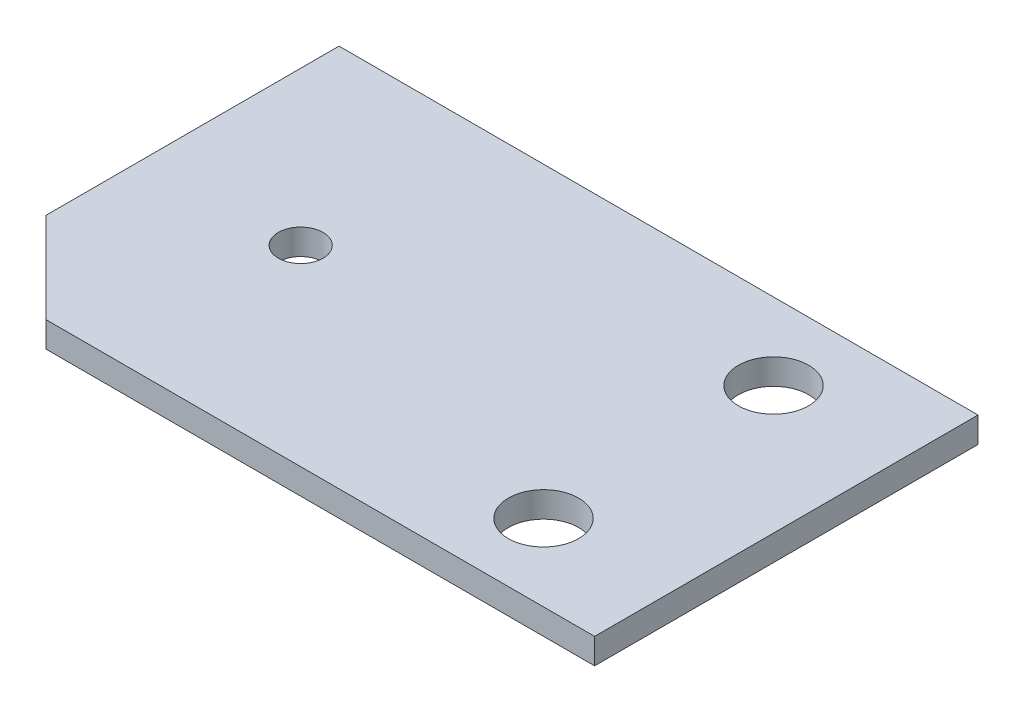
ISO-10303-21;
HEADER;
FILE_DESCRIPTION(('STEP AP214'),'2;1');
FILE_NAME('part.step','',(''),(''),'','','');
FILE_SCHEMA(('AUTOMOTIVE_DESIGN { 1 0 10303 214 1 1 1 1 }'));
ENDSEC;
DATA;
#1=APPLICATION_CONTEXT('core data for automotive mechanical design processes');
#2=APPLICATION_PROTOCOL_DEFINITION('international standard','automotive_design',2000,#1);
#3=PRODUCT_CONTEXT('',#1,'mechanical');
#4=PRODUCT('Part','Part','',(#3));
#5=PRODUCT_RELATED_PRODUCT_CATEGORY('part','',(#4));
#6=PRODUCT_DEFINITION_FORMATION('','',#4);
#7=PRODUCT_DEFINITION_CONTEXT('part definition',#1,'design');
#8=PRODUCT_DEFINITION('design','',#6,#7);
#9=PRODUCT_DEFINITION_SHAPE('','',#8);
#10=(LENGTH_UNIT() NAMED_UNIT(*) SI_UNIT(.MILLI.,.METRE.));
#11=(NAMED_UNIT(*) PLANE_ANGLE_UNIT() SI_UNIT($,.RADIAN.));
#12=(NAMED_UNIT(*) SI_UNIT($,.STERADIAN.) SOLID_ANGLE_UNIT());
#13=UNCERTAINTY_MEASURE_WITH_UNIT(LENGTH_MEASURE(1.E-05),#10,'distance_accuracy_value','');
#14=(GEOMETRIC_REPRESENTATION_CONTEXT(3) GLOBAL_UNCERTAINTY_ASSIGNED_CONTEXT((#13)) GLOBAL_UNIT_ASSIGNED_CONTEXT((#10,
#11,#12)) REPRESENTATION_CONTEXT('',''));
#15=CARTESIAN_POINT('',(0.,0.,0.));
#16=DIRECTION('',(0.,0.,1.));
#17=DIRECTION('',(1.,0.,0.));
#18=AXIS2_PLACEMENT_3D('',#15,#16,#17);
#19=CARTESIAN_POINT('',(0.,2.,-30.));
#20=DIRECTION('',(1.,0.,0.));
#21=DIRECTION('',(0.,0.,-1.));
#22=AXIS2_PLACEMENT_3D('',#19,#20,#21);
#23=PLANE('',#22);
#24=DIRECTION('',(0.,0.,1.));
#25=VECTOR('',#24,1.);
#26=CARTESIAN_POINT('',(0.,0.,-30.));
#27=LINE('',#26,#25);
#28=CARTESIAN_POINT('',(0.,0.,-30.));
#29=VERTEX_POINT('',#28);
#30=CARTESIAN_POINT('',(0.,0.,-7.07106781186549));
#31=VERTEX_POINT('',#30);
#32=EDGE_CURVE('E107',#29,#31,#27,.T.);
#33=ORIENTED_EDGE('',*,*,#32,.T.);
#34=DIRECTION('',(0.,1.,0.));
#35=VECTOR('',#34,1.);
#36=CARTESIAN_POINT('',(0.,0.,-7.07106781186549));
#37=LINE('',#36,#35);
#38=CARTESIAN_POINT('',(0.,2.,-7.07106781186549));
#39=VERTEX_POINT('',#38);
#40=EDGE_CURVE('E51',#31,#39,#37,.T.);
#41=ORIENTED_EDGE('',*,*,#40,.T.);
#42=DIRECTION('',(0.,0.,1.));
#43=VECTOR('',#42,1.);
#44=CARTESIAN_POINT('',(0.,2.,-30.));
#45=LINE('',#44,#43);
#46=CARTESIAN_POINT('',(0.,2.,-30.));
#47=VERTEX_POINT('',#46);
#48=EDGE_CURVE('E115',#47,#39,#45,.T.);
#49=ORIENTED_EDGE('',*,*,#48,.F.);
#50=DIRECTION('',(0.,-1.,0.));
#51=VECTOR('',#50,1.);
#52=CARTESIAN_POINT('',(0.,2.,-30.));
#53=LINE('',#52,#51);
#54=EDGE_CURVE('E116',#47,#29,#53,.T.);
#55=ORIENTED_EDGE('',*,*,#54,.T.);
#56=EDGE_LOOP('',(#33,#41,#49,#55));
#57=FACE_BOUND('',#56,.T.);
#58=ADVANCED_FACE('F37',(#57),#23,.F.);
#59=CARTESIAN_POINT('',(0.,2.,0.));
#60=DIRECTION('',(0.,0.,-1.));
#61=DIRECTION('',(-1.,0.,0.));
#62=AXIS2_PLACEMENT_3D('',#59,#60,#61);
#63=PLANE('',#62);
#64=DIRECTION('',(1.,0.,0.));
#65=VECTOR('',#64,1.);
#66=CARTESIAN_POINT('',(0.,2.,0.));
#67=LINE('',#66,#65);
#68=CARTESIAN_POINT('',(7.07106781186546,2.,0.));
#69=VERTEX_POINT('',#68);
#70=CARTESIAN_POINT('',(50.,2.,0.));
#71=VERTEX_POINT('',#70);
#72=EDGE_CURVE('E82',#69,#71,#67,.T.);
#73=ORIENTED_EDGE('',*,*,#72,.F.);
#74=DIRECTION('',(0.,1.,0.));
#75=VECTOR('',#74,1.);
#76=CARTESIAN_POINT('',(7.07106781186546,0.,0.));
#77=LINE('',#76,#75);
#78=CARTESIAN_POINT('',(7.07106781186546,0.,0.));
#79=VERTEX_POINT('',#78);
#80=EDGE_CURVE('E93',#79,#69,#77,.T.);
#81=ORIENTED_EDGE('',*,*,#80,.F.);
#82=DIRECTION('',(1.,0.,0.));
#83=VECTOR('',#82,1.);
#84=CARTESIAN_POINT('',(0.,0.,0.));
#85=LINE('',#84,#83);
#86=CARTESIAN_POINT('',(50.,0.,0.));
#87=VERTEX_POINT('',#86);
#88=EDGE_CURVE('E102',#79,#87,#85,.T.);
#89=ORIENTED_EDGE('',*,*,#88,.T.);
#90=DIRECTION('',(0.,-1.,0.));
#91=VECTOR('',#90,1.);
#92=CARTESIAN_POINT('',(50.,2.,0.));
#93=LINE('',#92,#91);
#94=EDGE_CURVE('E11',#71,#87,#93,.T.);
#95=ORIENTED_EDGE('',*,*,#94,.F.);
#96=EDGE_LOOP('',(#73,#81,#89,#95));
#97=FACE_BOUND('',#96,.T.);
#98=ADVANCED_FACE('F101',(#97),#63,.F.);
#99=CARTESIAN_POINT('',(50.,2.,0.));
#100=DIRECTION('',(-1.,0.,0.));
#101=DIRECTION('',(0.,0.,1.));
#102=AXIS2_PLACEMENT_3D('',#99,#100,#101);
#103=PLANE('',#102);
#104=DIRECTION('',(0.,0.,-1.));
#105=VECTOR('',#104,1.);
#106=CARTESIAN_POINT('',(50.,0.,0.));
#107=LINE('',#106,#105);
#108=CARTESIAN_POINT('',(50.,0.,-30.));
#109=VERTEX_POINT('',#108);
#110=EDGE_CURVE('E106',#87,#109,#107,.T.);
#111=ORIENTED_EDGE('',*,*,#110,.T.);
#112=DIRECTION('',(0.,-1.,0.));
#113=VECTOR('',#112,1.);
#114=CARTESIAN_POINT('',(50.,2.,-30.));
#115=LINE('',#114,#113);
#116=CARTESIAN_POINT('',(50.,2.,-30.));
#117=VERTEX_POINT('',#116);
#118=EDGE_CURVE('E44',#117,#109,#115,.T.);
#119=ORIENTED_EDGE('',*,*,#118,.F.);
#120=DIRECTION('',(0.,0.,-1.));
#121=VECTOR('',#120,1.);
#122=CARTESIAN_POINT('',(50.,2.,0.));
#123=LINE('',#122,#121);
#124=EDGE_CURVE('E124',#71,#117,#123,.T.);
#125=ORIENTED_EDGE('',*,*,#124,.F.);
#126=ORIENTED_EDGE('',*,*,#94,.T.);
#127=EDGE_LOOP('',(#111,#119,#125,#126));
#128=FACE_BOUND('',#127,.T.);
#129=ADVANCED_FACE('F132',(#128),#103,.F.);
#130=CARTESIAN_POINT('',(50.,2.,-30.));
#131=DIRECTION('',(0.,0.,1.));
#132=DIRECTION('',(1.,0.,0.));
#133=AXIS2_PLACEMENT_3D('',#130,#131,#132);
#134=PLANE('',#133);
#135=DIRECTION('',(-1.,0.,0.));
#136=VECTOR('',#135,1.);
#137=CARTESIAN_POINT('',(50.,0.,-30.));
#138=LINE('',#137,#136);
#139=EDGE_CURVE('E77',#109,#29,#138,.T.);
#140=ORIENTED_EDGE('',*,*,#139,.T.);
#141=ORIENTED_EDGE('',*,*,#54,.F.);
#142=DIRECTION('',(-1.,0.,0.));
#143=VECTOR('',#142,1.);
#144=CARTESIAN_POINT('',(50.,2.,-30.));
#145=LINE('',#144,#143);
#146=EDGE_CURVE('E60',#117,#47,#145,.T.);
#147=ORIENTED_EDGE('',*,*,#146,.F.);
#148=ORIENTED_EDGE('',*,*,#118,.T.);
#149=EDGE_LOOP('',(#140,#141,#147,#148));
#150=FACE_BOUND('',#149,.T.);
#151=ADVANCED_FACE('F118',(#150),#134,.F.);
#152=CARTESIAN_POINT('',(0.,2.,0.));
#153=DIRECTION('',(0.,1.,0.));
#154=DIRECTION('',(0.,0.,1.));
#155=AXIS2_PLACEMENT_3D('',#152,#153,#154);
#156=PLANE('',#155);
#157=CARTESIAN_POINT('',(39.9999999999999,2.,-24.));
#158=DIRECTION('',(0.,1.,0.));
#159=DIRECTION('',(0.,0.,1.));
#160=AXIS2_PLACEMENT_3D('',#157,#158,#159);
#161=CIRCLE('',#160,2.75000000000001);
#162=CARTESIAN_POINT('',(39.9999999999999,2.,-21.25));
#163=VERTEX_POINT('',#162);
#164=EDGE_CURVE('E216',#163,#163,#161,.T.);
#165=ORIENTED_EDGE('',*,*,#164,.F.);
#166=EDGE_LOOP('',(#165));
#167=FACE_BOUND('',#166,.T.);
#168=DIRECTION('',(-0.707106781186546,0.,-0.707106781186549));
#169=VECTOR('',#168,1.);
#170=CARTESIAN_POINT('',(0.,2.,-7.07106781186549));
#171=LINE('',#170,#169);
#172=EDGE_CURVE('E98',#69,#39,#171,.T.);
#173=ORIENTED_EDGE('',*,*,#172,.F.);
#174=ORIENTED_EDGE('',*,*,#72,.T.);
#175=ORIENTED_EDGE('',*,*,#124,.T.);
#176=ORIENTED_EDGE('',*,*,#146,.T.);
#177=ORIENTED_EDGE('',*,*,#48,.T.);
#178=EDGE_LOOP('',(#173,#174,#175,#176,#177));
#179=FACE_BOUND('',#178,.T.);
#180=CARTESIAN_POINT('',(12.,2.,-15.));
#181=DIRECTION('',(0.,1.,0.));
#182=DIRECTION('',(0.,0.,1.));
#183=AXIS2_PLACEMENT_3D('',#180,#181,#182);
#184=CIRCLE('',#183,1.75);
#185=CARTESIAN_POINT('',(12.,2.,-13.25));
#186=VERTEX_POINT('',#185);
#187=EDGE_CURVE('E227',#186,#186,#184,.T.);
#188=ORIENTED_EDGE('',*,*,#187,.F.);
#189=EDGE_LOOP('',(#188));
#190=FACE_BOUND('',#189,.T.);
#191=CARTESIAN_POINT('',(40.,2.,-6.));
#192=DIRECTION('',(0.,1.,0.));
#193=DIRECTION('',(0.,0.,1.));
#194=AXIS2_PLACEMENT_3D('',#191,#192,#193);
#195=CIRCLE('',#194,2.75000000000001);
#196=CARTESIAN_POINT('',(40.,2.,-3.24999999999999));
#197=VERTEX_POINT('',#196);
#198=EDGE_CURVE('E127',#197,#197,#195,.T.);
#199=ORIENTED_EDGE('',*,*,#198,.F.);
#200=EDGE_LOOP('',(#199));
#201=FACE_BOUND('',#200,.T.);
#202=ADVANCED_FACE('F130',(#167,#179,#190,#201),#156,.T.);
#203=CARTESIAN_POINT('',(0.,0.,0.));
#204=DIRECTION('',(0.,1.,0.));
#205=DIRECTION('',(0.,0.,1.));
#206=AXIS2_PLACEMENT_3D('',#203,#204,#205);
#207=PLANE('',#206);
#208=CARTESIAN_POINT('',(39.9999999999999,0.,-24.));
#209=DIRECTION('',(0.,1.,0.));
#210=DIRECTION('',(0.,0.,1.));
#211=AXIS2_PLACEMENT_3D('',#208,#209,#210);
#212=CIRCLE('',#211,2.75000000000001);
#213=CARTESIAN_POINT('',(39.9999999999999,0.,-21.25));
#214=VERTEX_POINT('',#213);
#215=EDGE_CURVE('E213',#214,#214,#212,.T.);
#216=ORIENTED_EDGE('',*,*,#215,.T.);
#217=EDGE_LOOP('',(#216));
#218=FACE_BOUND('',#217,.T.);
#219=CARTESIAN_POINT('',(12.,0.,-15.));
#220=DIRECTION('',(0.,1.,0.));
#221=DIRECTION('',(0.,0.,1.));
#222=AXIS2_PLACEMENT_3D('',#219,#220,#221);
#223=CIRCLE('',#222,1.75);
#224=CARTESIAN_POINT('',(12.,0.,-13.25));
#225=VERTEX_POINT('',#224);
#226=EDGE_CURVE('E223',#225,#225,#223,.T.);
#227=ORIENTED_EDGE('',*,*,#226,.T.);
#228=EDGE_LOOP('',(#227));
#229=FACE_BOUND('',#228,.T.);
#230=CARTESIAN_POINT('',(40.,0.,-6.));
#231=DIRECTION('',(0.,1.,0.));
#232=DIRECTION('',(0.,0.,1.));
#233=AXIS2_PLACEMENT_3D('',#230,#231,#232);
#234=CIRCLE('',#233,2.75000000000001);
#235=CARTESIAN_POINT('',(40.,0.,-3.24999999999999));
#236=VERTEX_POINT('',#235);
#237=EDGE_CURVE('E110',#236,#236,#234,.T.);
#238=ORIENTED_EDGE('',*,*,#237,.T.);
#239=EDGE_LOOP('',(#238));
#240=FACE_BOUND('',#239,.T.);
#241=ORIENTED_EDGE('',*,*,#88,.F.);
#242=DIRECTION('',(-0.707106781186546,0.,-0.707106781186549));
#243=VECTOR('',#242,1.);
#244=CARTESIAN_POINT('',(0.,0.,-7.07106781186549));
#245=LINE('',#244,#243);
#246=EDGE_CURVE('E90',#79,#31,#245,.T.);
#247=ORIENTED_EDGE('',*,*,#246,.T.);
#248=ORIENTED_EDGE('',*,*,#32,.F.);
#249=ORIENTED_EDGE('',*,*,#139,.F.);
#250=ORIENTED_EDGE('',*,*,#110,.F.);
#251=EDGE_LOOP('',(#241,#247,#248,#249,#250));
#252=FACE_BOUND('',#251,.T.);
#253=ADVANCED_FACE('F105',(#218,#229,#240,#252),#207,.F.);
#254=CARTESIAN_POINT('',(40.,0.,-6.));
#255=DIRECTION('',(0.,1.,0.));
#256=DIRECTION('',(0.,0.,1.));
#257=AXIS2_PLACEMENT_3D('',#254,#255,#256);
#258=CYLINDRICAL_SURFACE('',#257,2.75000000000001);
#259=ORIENTED_EDGE('',*,*,#237,.F.);
#260=EDGE_LOOP('',(#259));
#261=FACE_BOUND('',#260,.T.);
#262=ORIENTED_EDGE('',*,*,#198,.T.);
#263=EDGE_LOOP('',(#262));
#264=FACE_BOUND('',#263,.T.);
#265=ADVANCED_FACE('F168',(#261,#264),#258,.F.);
#266=CARTESIAN_POINT('',(12.,0.,-15.));
#267=DIRECTION('',(0.,1.,0.));
#268=DIRECTION('',(0.,0.,1.));
#269=AXIS2_PLACEMENT_3D('',#266,#267,#268);
#270=CYLINDRICAL_SURFACE('',#269,1.75);
#271=ORIENTED_EDGE('',*,*,#226,.F.);
#272=EDGE_LOOP('',(#271));
#273=FACE_BOUND('',#272,.T.);
#274=ORIENTED_EDGE('',*,*,#187,.T.);
#275=EDGE_LOOP('',(#274));
#276=FACE_BOUND('',#275,.T.);
#277=ADVANCED_FACE('F178',(#273,#276),#270,.F.);
#278=CARTESIAN_POINT('',(0.,0.,-7.07106781186549));
#279=DIRECTION('',(0.707106781186549,0.,-0.707106781186546));
#280=DIRECTION('',(-0.707106781186546,0.,-0.707106781186549));
#281=AXIS2_PLACEMENT_3D('',#278,#279,#280);
#282=PLANE('',#281);
#283=ORIENTED_EDGE('',*,*,#172,.T.);
#284=ORIENTED_EDGE('',*,*,#40,.F.);
#285=ORIENTED_EDGE('',*,*,#246,.F.);
#286=ORIENTED_EDGE('',*,*,#80,.T.);
#287=EDGE_LOOP('',(#283,#284,#285,#286));
#288=FACE_BOUND('',#287,.T.);
#289=ADVANCED_FACE('F92',(#288),#282,.F.);
#290=CARTESIAN_POINT('',(39.9999999999999,0.,-24.));
#291=DIRECTION('',(0.,1.,0.));
#292=DIRECTION('',(0.,0.,1.));
#293=AXIS2_PLACEMENT_3D('',#290,#291,#292);
#294=CYLINDRICAL_SURFACE('',#293,2.75000000000001);
#295=ORIENTED_EDGE('',*,*,#215,.F.);
#296=EDGE_LOOP('',(#295));
#297=FACE_BOUND('',#296,.T.);
#298=ORIENTED_EDGE('',*,*,#164,.T.);
#299=EDGE_LOOP('',(#298));
#300=FACE_BOUND('',#299,.T.);
#301=ADVANCED_FACE('F197',(#297,#300),#294,.F.);
#302=CLOSED_SHELL('',(#58,#98,#129,#151,#202,#253,#265,#277,#289,#301));
#303=MANIFOLD_SOLID_BREP('B2',#302);
#304=ADVANCED_BREP_SHAPE_REPRESENTATION('',(#18,#303),#14);
#305=SHAPE_DEFINITION_REPRESENTATION(#9,#304);
ENDSEC;
END-ISO-10303-21;
